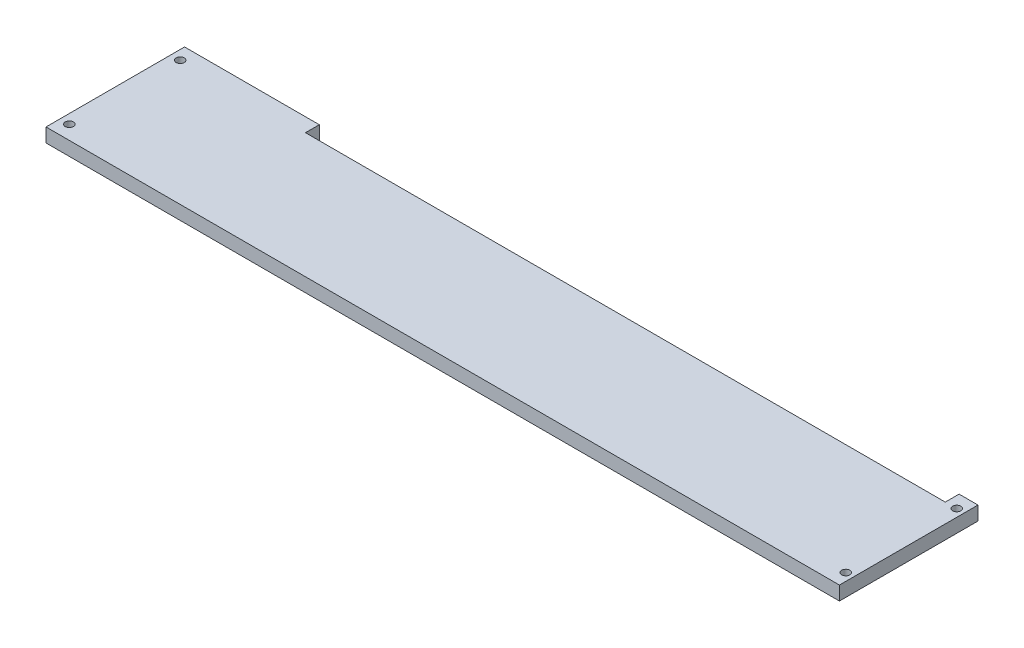
ISO-10303-21;
HEADER;
FILE_DESCRIPTION(('STEP AP214'),'2;1');
FILE_NAME('part.step','',(''),(''),'','','');
FILE_SCHEMA(('AUTOMOTIVE_DESIGN { 1 0 10303 214 1 1 1 1 }'));
ENDSEC;
DATA;
#1=APPLICATION_CONTEXT('core data for automotive mechanical design processes');
#2=APPLICATION_PROTOCOL_DEFINITION('international standard','automotive_design',2000,#1);
#3=PRODUCT_CONTEXT('',#1,'mechanical');
#4=PRODUCT('Part','Part','',(#3));
#5=PRODUCT_RELATED_PRODUCT_CATEGORY('part','',(#4));
#6=PRODUCT_DEFINITION_FORMATION('','',#4);
#7=PRODUCT_DEFINITION_CONTEXT('part definition',#1,'design');
#8=PRODUCT_DEFINITION('design','',#6,#7);
#9=PRODUCT_DEFINITION_SHAPE('','',#8);
#10=(LENGTH_UNIT() NAMED_UNIT(*) SI_UNIT(.MILLI.,.METRE.));
#11=(NAMED_UNIT(*) PLANE_ANGLE_UNIT() SI_UNIT($,.RADIAN.));
#12=(NAMED_UNIT(*) SI_UNIT($,.STERADIAN.) SOLID_ANGLE_UNIT());
#13=UNCERTAINTY_MEASURE_WITH_UNIT(LENGTH_MEASURE(1.E-05),#10,'distance_accuracy_value','');
#14=(GEOMETRIC_REPRESENTATION_CONTEXT(3) GLOBAL_UNCERTAINTY_ASSIGNED_CONTEXT((#13)) GLOBAL_UNIT_ASSIGNED_CONTEXT((#10,
#11,#12)) REPRESENTATION_CONTEXT('',''));
#15=CARTESIAN_POINT('',(0.,0.,0.));
#16=DIRECTION('',(0.,0.,1.));
#17=DIRECTION('',(1.,0.,0.));
#18=AXIS2_PLACEMENT_3D('',#15,#16,#17);
#19=CARTESIAN_POINT('',(540.4,-0.000999999999999265,85.68));
#20=DIRECTION('',(0.,1.,0.));
#21=DIRECTION('',(0.,0.,1.));
#22=AXIS2_PLACEMENT_3D('',#19,#20,#21);
#23=CYLINDRICAL_SURFACE('',#22,2.79499999999996);
#24=CARTESIAN_POINT('',(540.4,9.55,85.68));
#25=DIRECTION('',(0.,1.,0.));
#26=DIRECTION('',(0.,0.,1.));
#27=AXIS2_PLACEMENT_3D('',#24,#25,#26);
#28=CIRCLE('',#27,2.79499999999996);
#29=CARTESIAN_POINT('',(540.4,9.55,88.475));
#30=VERTEX_POINT('',#29);
#31=EDGE_CURVE('E195',#30,#30,#28,.T.);
#32=ORIENTED_EDGE('',*,*,#31,.T.);
#33=EDGE_LOOP('',(#32));
#34=FACE_BOUND('',#33,.T.);
#35=CARTESIAN_POINT('',(540.4,5.2,85.68));
#36=DIRECTION('',(0.,-1.,0.));
#37=DIRECTION('',(0.,0.,-1.));
#38=AXIS2_PLACEMENT_3D('',#35,#36,#37);
#39=CIRCLE('',#38,2.79499999999996);
#40=CARTESIAN_POINT('',(540.4,5.2,82.885));
#41=VERTEX_POINT('',#40);
#42=EDGE_CURVE('E37',#41,#41,#39,.F.);
#43=ORIENTED_EDGE('',*,*,#42,.F.);
#44=EDGE_LOOP('',(#43));
#45=FACE_BOUND('',#44,.T.);
#46=ADVANCED_FACE('F33',(#34,#45),#23,.F.);
#47=CARTESIAN_POINT('',(540.4,-0.000999999999999265,9.38));
#48=DIRECTION('',(0.,1.,0.));
#49=DIRECTION('',(0.,0.,1.));
#50=AXIS2_PLACEMENT_3D('',#47,#48,#49);
#51=CYLINDRICAL_SURFACE('',#50,2.79499999999996);
#52=CARTESIAN_POINT('',(540.4,9.55,9.38));
#53=DIRECTION('',(0.,1.,0.));
#54=DIRECTION('',(0.,0.,1.));
#55=AXIS2_PLACEMENT_3D('',#52,#53,#54);
#56=CIRCLE('',#55,2.79499999999996);
#57=CARTESIAN_POINT('',(540.4,9.55,12.175));
#58=VERTEX_POINT('',#57);
#59=EDGE_CURVE('E162',#58,#58,#56,.T.);
#60=ORIENTED_EDGE('',*,*,#59,.T.);
#61=EDGE_LOOP('',(#60));
#62=FACE_BOUND('',#61,.T.);
#63=CARTESIAN_POINT('',(540.4,5.2,9.38));
#64=DIRECTION('',(0.,-1.,0.));
#65=DIRECTION('',(0.,0.,-1.));
#66=AXIS2_PLACEMENT_3D('',#63,#64,#65);
#67=CIRCLE('',#66,2.79499999999996);
#68=CARTESIAN_POINT('',(540.4,5.2,6.58500000000004));
#69=VERTEX_POINT('',#68);
#70=EDGE_CURVE('E168',#69,#69,#67,.F.);
#71=ORIENTED_EDGE('',*,*,#70,.F.);
#72=EDGE_LOOP('',(#71));
#73=FACE_BOUND('',#72,.T.);
#74=ADVANCED_FACE('F237',(#62,#73),#51,.F.);
#75=CARTESIAN_POINT('',(6.40000000000001,-0.000999999999999265,9.38));
#76=DIRECTION('',(0.,1.,0.));
#77=DIRECTION('',(0.,0.,1.));
#78=AXIS2_PLACEMENT_3D('',#75,#76,#77);
#79=CYLINDRICAL_SURFACE('',#78,2.795);
#80=CARTESIAN_POINT('',(6.40000000000001,9.55,9.38));
#81=DIRECTION('',(0.,1.,0.));
#82=DIRECTION('',(0.,0.,1.));
#83=AXIS2_PLACEMENT_3D('',#80,#81,#82);
#84=CIRCLE('',#83,2.795);
#85=CARTESIAN_POINT('',(6.40000000000001,9.55,12.175));
#86=VERTEX_POINT('',#85);
#87=EDGE_CURVE('E136',#86,#86,#84,.T.);
#88=ORIENTED_EDGE('',*,*,#87,.T.);
#89=EDGE_LOOP('',(#88));
#90=FACE_BOUND('',#89,.T.);
#91=CARTESIAN_POINT('',(6.40000000000001,5.2,9.38));
#92=DIRECTION('',(0.,-1.,0.));
#93=DIRECTION('',(0.,0.,-1.));
#94=AXIS2_PLACEMENT_3D('',#91,#92,#93);
#95=CIRCLE('',#94,2.795);
#96=CARTESIAN_POINT('',(6.40000000000001,5.2,6.585));
#97=VERTEX_POINT('',#96);
#98=EDGE_CURVE('E164',#97,#97,#95,.F.);
#99=ORIENTED_EDGE('',*,*,#98,.F.);
#100=EDGE_LOOP('',(#99));
#101=FACE_BOUND('',#100,.T.);
#102=ADVANCED_FACE('F243',(#90,#101),#79,.F.);
#103=CARTESIAN_POINT('',(6.40000000000001,-0.000999999999999265,85.68));
#104=DIRECTION('',(0.,1.,0.));
#105=DIRECTION('',(0.,0.,1.));
#106=AXIS2_PLACEMENT_3D('',#103,#104,#105);
#107=CYLINDRICAL_SURFACE('',#106,2.795);
#108=CARTESIAN_POINT('',(6.40000000000001,9.55,85.68));
#109=DIRECTION('',(0.,1.,0.));
#110=DIRECTION('',(0.,0.,1.));
#111=AXIS2_PLACEMENT_3D('',#108,#109,#110);
#112=CIRCLE('',#111,2.795);
#113=CARTESIAN_POINT('',(6.40000000000001,9.55,88.475));
#114=VERTEX_POINT('',#113);
#115=EDGE_CURVE('E198',#114,#114,#112,.T.);
#116=ORIENTED_EDGE('',*,*,#115,.T.);
#117=EDGE_LOOP('',(#116));
#118=FACE_BOUND('',#117,.T.);
#119=CARTESIAN_POINT('',(6.40000000000001,5.2,85.68));
#120=DIRECTION('',(0.,-1.,0.));
#121=DIRECTION('',(0.,0.,-1.));
#122=AXIS2_PLACEMENT_3D('',#119,#120,#121);
#123=CIRCLE('',#122,2.795);
#124=CARTESIAN_POINT('',(6.40000000000001,5.2,82.885));
#125=VERTEX_POINT('',#124);
#126=EDGE_CURVE('E159',#125,#125,#123,.F.);
#127=ORIENTED_EDGE('',*,*,#126,.F.);
#128=EDGE_LOOP('',(#127));
#129=FACE_BOUND('',#128,.T.);
#130=ADVANCED_FACE('F249',(#118,#129),#107,.F.);
#131=CARTESIAN_POINT('',(0.,9.55,0.));
#132=DIRECTION('',(1.,0.,0.));
#133=DIRECTION('',(0.,0.,-1.));
#134=AXIS2_PLACEMENT_3D('',#131,#132,#133);
#135=PLANE('',#134);
#136=DIRECTION('',(0.,0.,1.));
#137=VECTOR('',#136,1.);
#138=CARTESIAN_POINT('',(0.,0.,0.));
#139=LINE('',#138,#137);
#140=CARTESIAN_POINT('',(0.,0.,0.));
#141=VERTEX_POINT('',#140);
#142=CARTESIAN_POINT('',(0.,0.,95.3));
#143=VERTEX_POINT('',#142);
#144=EDGE_CURVE('E132',#141,#143,#139,.T.);
#145=ORIENTED_EDGE('',*,*,#144,.T.);
#146=DIRECTION('',(0.,-1.,0.));
#147=VECTOR('',#146,1.);
#148=CARTESIAN_POINT('',(0.,9.55,95.3));
#149=LINE('',#148,#147);
#150=CARTESIAN_POINT('',(0.,9.55,95.3));
#151=VERTEX_POINT('',#150);
#152=EDGE_CURVE('E11',#151,#143,#149,.T.);
#153=ORIENTED_EDGE('',*,*,#152,.F.);
#154=DIRECTION('',(0.,0.,1.));
#155=VECTOR('',#154,1.);
#156=CARTESIAN_POINT('',(0.,9.55,0.));
#157=LINE('',#156,#155);
#158=CARTESIAN_POINT('',(0.,9.55,0.));
#159=VERTEX_POINT('',#158);
#160=EDGE_CURVE('E147',#159,#151,#157,.T.);
#161=ORIENTED_EDGE('',*,*,#160,.F.);
#162=DIRECTION('',(0.,-1.,0.));
#163=VECTOR('',#162,1.);
#164=CARTESIAN_POINT('',(0.,9.55,0.));
#165=LINE('',#164,#163);
#166=EDGE_CURVE('E128',#159,#141,#165,.T.);
#167=ORIENTED_EDGE('',*,*,#166,.T.);
#168=EDGE_LOOP('',(#145,#153,#161,#167));
#169=FACE_BOUND('',#168,.T.);
#170=ADVANCED_FACE('F35',(#169),#135,.F.);
#171=CARTESIAN_POINT('',(0.,9.55,95.3));
#172=DIRECTION('',(0.,0.,-1.));
#173=DIRECTION('',(-1.,0.,0.));
#174=AXIS2_PLACEMENT_3D('',#171,#172,#173);
#175=PLANE('',#174);
#176=DIRECTION('',(1.,0.,0.));
#177=VECTOR('',#176,1.);
#178=CARTESIAN_POINT('',(0.,0.,95.3));
#179=LINE('',#178,#177);
#180=CARTESIAN_POINT('',(545.64,0.,95.3));
#181=VERTEX_POINT('',#180);
#182=EDGE_CURVE('E135',#143,#181,#179,.T.);
#183=ORIENTED_EDGE('',*,*,#182,.T.);
#184=DIRECTION('',(0.,-1.,0.));
#185=VECTOR('',#184,1.);
#186=CARTESIAN_POINT('',(545.64,9.55,95.3));
#187=LINE('',#186,#185);
#188=CARTESIAN_POINT('',(545.64,9.55,95.3));
#189=VERTEX_POINT('',#188);
#190=EDGE_CURVE('E43',#189,#181,#187,.T.);
#191=ORIENTED_EDGE('',*,*,#190,.F.);
#192=DIRECTION('',(1.,0.,0.));
#193=VECTOR('',#192,1.);
#194=CARTESIAN_POINT('',(0.,9.55,95.3));
#195=LINE('',#194,#193);
#196=EDGE_CURVE('E95',#151,#189,#195,.T.);
#197=ORIENTED_EDGE('',*,*,#196,.F.);
#198=ORIENTED_EDGE('',*,*,#152,.T.);
#199=EDGE_LOOP('',(#183,#191,#197,#198));
#200=FACE_BOUND('',#199,.T.);
#201=ADVANCED_FACE('F415',(#200),#175,.F.);
#202=CARTESIAN_POINT('',(545.64,9.55,0.));
#203=DIRECTION('',(-1.,0.,0.));
#204=DIRECTION('',(0.,0.,1.));
#205=AXIS2_PLACEMENT_3D('',#202,#203,#204);
#206=PLANE('',#205);
#207=DIRECTION('',(0.,0.,-1.));
#208=VECTOR('',#207,1.);
#209=CARTESIAN_POINT('',(545.64,0.,0.));
#210=LINE('',#209,#208);
#211=CARTESIAN_POINT('',(545.64,0.,0.));
#212=VERTEX_POINT('',#211);
#213=EDGE_CURVE('E138',#181,#212,#210,.T.);
#214=ORIENTED_EDGE('',*,*,#213,.T.);
#215=DIRECTION('',(0.,-1.,0.));
#216=VECTOR('',#215,1.);
#217=CARTESIAN_POINT('',(545.64,9.55,0.));
#218=LINE('',#217,#216);
#219=CARTESIAN_POINT('',(545.64,9.55,0.));
#220=VERTEX_POINT('',#219);
#221=EDGE_CURVE('E154',#220,#212,#218,.T.);
#222=ORIENTED_EDGE('',*,*,#221,.F.);
#223=DIRECTION('',(0.,0.,-1.));
#224=VECTOR('',#223,1.);
#225=CARTESIAN_POINT('',(545.64,9.55,0.));
#226=LINE('',#225,#224);
#227=EDGE_CURVE('E205',#189,#220,#226,.T.);
#228=ORIENTED_EDGE('',*,*,#227,.F.);
#229=ORIENTED_EDGE('',*,*,#190,.T.);
#230=EDGE_LOOP('',(#214,#222,#228,#229));
#231=FACE_BOUND('',#230,.T.);
#232=ADVANCED_FACE('F407',(#231),#206,.F.);
#233=CARTESIAN_POINT('',(532.64,9.55,0.));
#234=DIRECTION('',(0.,0.,1.));
#235=DIRECTION('',(1.,0.,0.));
#236=AXIS2_PLACEMENT_3D('',#233,#234,#235);
#237=PLANE('',#236);
#238=DIRECTION('',(-1.,0.,0.));
#239=VECTOR('',#238,1.);
#240=CARTESIAN_POINT('',(532.64,0.,0.));
#241=LINE('',#240,#239);
#242=CARTESIAN_POINT('',(532.64,0.,0.));
#243=VERTEX_POINT('',#242);
#244=EDGE_CURVE('E140',#212,#243,#241,.T.);
#245=ORIENTED_EDGE('',*,*,#244,.T.);
#246=DIRECTION('',(0.,-1.,0.));
#247=VECTOR('',#246,1.);
#248=CARTESIAN_POINT('',(532.64,9.55,0.));
#249=LINE('',#248,#247);
#250=CARTESIAN_POINT('',(532.64,9.55,0.));
#251=VERTEX_POINT('',#250);
#252=EDGE_CURVE('E151',#251,#243,#249,.T.);
#253=ORIENTED_EDGE('',*,*,#252,.F.);
#254=DIRECTION('',(-1.,0.,0.));
#255=VECTOR('',#254,1.);
#256=CARTESIAN_POINT('',(532.64,9.55,0.));
#257=LINE('',#256,#255);
#258=EDGE_CURVE('E207',#220,#251,#257,.T.);
#259=ORIENTED_EDGE('',*,*,#258,.F.);
#260=ORIENTED_EDGE('',*,*,#221,.T.);
#261=EDGE_LOOP('',(#245,#253,#259,#260));
#262=FACE_BOUND('',#261,.T.);
#263=ADVANCED_FACE('F213',(#262),#237,.F.);
#264=CARTESIAN_POINT('',(532.64,9.55,0.));
#265=DIRECTION('',(1.,0.,0.));
#266=DIRECTION('',(0.,0.,-1.));
#267=AXIS2_PLACEMENT_3D('',#264,#265,#266);
#268=PLANE('',#267);
#269=DIRECTION('',(0.,0.,1.));
#270=VECTOR('',#269,1.);
#271=CARTESIAN_POINT('',(532.64,0.,0.));
#272=LINE('',#271,#270);
#273=CARTESIAN_POINT('',(532.64,0.,9.5));
#274=VERTEX_POINT('',#273);
#275=EDGE_CURVE('E142',#243,#274,#272,.T.);
#276=ORIENTED_EDGE('',*,*,#275,.T.);
#277=DIRECTION('',(0.,-1.,0.));
#278=VECTOR('',#277,1.);
#279=CARTESIAN_POINT('',(532.64,9.55,9.5));
#280=LINE('',#279,#278);
#281=CARTESIAN_POINT('',(532.64,9.55,9.5));
#282=VERTEX_POINT('',#281);
#283=EDGE_CURVE('E123',#282,#274,#280,.T.);
#284=ORIENTED_EDGE('',*,*,#283,.F.);
#285=DIRECTION('',(0.,0.,1.));
#286=VECTOR('',#285,1.);
#287=CARTESIAN_POINT('',(532.64,9.55,0.));
#288=LINE('',#287,#286);
#289=EDGE_CURVE('E114',#251,#282,#288,.T.);
#290=ORIENTED_EDGE('',*,*,#289,.F.);
#291=ORIENTED_EDGE('',*,*,#252,.T.);
#292=EDGE_LOOP('',(#276,#284,#290,#291));
#293=FACE_BOUND('',#292,.T.);
#294=ADVANCED_FACE('F217',(#293),#268,.F.);
#295=CARTESIAN_POINT('',(92.64,9.55,9.5));
#296=DIRECTION('',(0.,0.,1.));
#297=DIRECTION('',(1.,0.,0.));
#298=AXIS2_PLACEMENT_3D('',#295,#296,#297);
#299=PLANE('',#298);
#300=DIRECTION('',(-1.,0.,0.));
#301=VECTOR('',#300,1.);
#302=CARTESIAN_POINT('',(92.64,0.,9.5));
#303=LINE('',#302,#301);
#304=CARTESIAN_POINT('',(92.64,0.,9.5));
#305=VERTEX_POINT('',#304);
#306=EDGE_CURVE('E122',#274,#305,#303,.T.);
#307=ORIENTED_EDGE('',*,*,#306,.T.);
#308=DIRECTION('',(0.,-1.,0.));
#309=VECTOR('',#308,1.);
#310=CARTESIAN_POINT('',(92.64,9.55,9.5));
#311=LINE('',#310,#309);
#312=CARTESIAN_POINT('',(92.64,9.55,9.5));
#313=VERTEX_POINT('',#312);
#314=EDGE_CURVE('E119',#313,#305,#311,.T.);
#315=ORIENTED_EDGE('',*,*,#314,.F.);
#316=DIRECTION('',(-1.,0.,0.));
#317=VECTOR('',#316,1.);
#318=CARTESIAN_POINT('',(92.64,9.55,9.5));
#319=LINE('',#318,#317);
#320=EDGE_CURVE('E108',#282,#313,#319,.T.);
#321=ORIENTED_EDGE('',*,*,#320,.F.);
#322=ORIENTED_EDGE('',*,*,#283,.T.);
#323=EDGE_LOOP('',(#307,#315,#321,#322));
#324=FACE_BOUND('',#323,.T.);
#325=ADVANCED_FACE('F120',(#324),#299,.F.);
#326=CARTESIAN_POINT('',(92.64,9.55,0.));
#327=DIRECTION('',(-1.,0.,0.));
#328=DIRECTION('',(0.,0.,1.));
#329=AXIS2_PLACEMENT_3D('',#326,#327,#328);
#330=PLANE('',#329);
#331=DIRECTION('',(0.,0.,-1.));
#332=VECTOR('',#331,1.);
#333=CARTESIAN_POINT('',(92.64,0.,0.));
#334=LINE('',#333,#332);
#335=CARTESIAN_POINT('',(92.64,0.,0.));
#336=VERTEX_POINT('',#335);
#337=EDGE_CURVE('E81',#305,#336,#334,.T.);
#338=ORIENTED_EDGE('',*,*,#337,.T.);
#339=DIRECTION('',(0.,-1.,0.));
#340=VECTOR('',#339,1.);
#341=CARTESIAN_POINT('',(92.64,9.55,0.));
#342=LINE('',#341,#340);
#343=CARTESIAN_POINT('',(92.64,9.55,0.));
#344=VERTEX_POINT('',#343);
#345=EDGE_CURVE('E124',#344,#336,#342,.T.);
#346=ORIENTED_EDGE('',*,*,#345,.F.);
#347=DIRECTION('',(0.,0.,-1.));
#348=VECTOR('',#347,1.);
#349=CARTESIAN_POINT('',(92.64,9.55,0.));
#350=LINE('',#349,#348);
#351=EDGE_CURVE('E112',#313,#344,#350,.T.);
#352=ORIENTED_EDGE('',*,*,#351,.F.);
#353=ORIENTED_EDGE('',*,*,#314,.T.);
#354=EDGE_LOOP('',(#338,#346,#352,#353));
#355=FACE_BOUND('',#354,.T.);
#356=ADVANCED_FACE('F126',(#355),#330,.F.);
#357=CARTESIAN_POINT('',(0.,9.55,0.));
#358=DIRECTION('',(0.,0.,1.));
#359=DIRECTION('',(1.,0.,0.));
#360=AXIS2_PLACEMENT_3D('',#357,#358,#359);
#361=PLANE('',#360);
#362=DIRECTION('',(-1.,0.,0.));
#363=VECTOR('',#362,1.);
#364=CARTESIAN_POINT('',(0.,0.,0.));
#365=LINE('',#364,#363);
#366=EDGE_CURVE('E87',#336,#141,#365,.T.);
#367=ORIENTED_EDGE('',*,*,#366,.T.);
#368=ORIENTED_EDGE('',*,*,#166,.F.);
#369=DIRECTION('',(-1.,0.,0.));
#370=VECTOR('',#369,1.);
#371=CARTESIAN_POINT('',(0.,9.55,0.));
#372=LINE('',#371,#370);
#373=EDGE_CURVE('E52',#344,#159,#372,.T.);
#374=ORIENTED_EDGE('',*,*,#373,.F.);
#375=ORIENTED_EDGE('',*,*,#345,.T.);
#376=EDGE_LOOP('',(#367,#368,#374,#375));
#377=FACE_BOUND('',#376,.T.);
#378=ADVANCED_FACE('F225',(#377),#361,.F.);
#379=CARTESIAN_POINT('',(0.,9.55,95.3));
#380=DIRECTION('',(0.,1.,0.));
#381=DIRECTION('',(0.,0.,1.));
#382=AXIS2_PLACEMENT_3D('',#379,#380,#381);
#383=PLANE('',#382);
#384=ORIENTED_EDGE('',*,*,#59,.F.);
#385=EDGE_LOOP('',(#384));
#386=FACE_BOUND('',#385,.T.);
#387=ORIENTED_EDGE('',*,*,#31,.F.);
#388=EDGE_LOOP('',(#387));
#389=FACE_BOUND('',#388,.T.);
#390=ORIENTED_EDGE('',*,*,#115,.F.);
#391=EDGE_LOOP('',(#390));
#392=FACE_BOUND('',#391,.T.);
#393=ORIENTED_EDGE('',*,*,#87,.F.);
#394=EDGE_LOOP('',(#393));
#395=FACE_BOUND('',#394,.T.);
#396=ORIENTED_EDGE('',*,*,#160,.T.);
#397=ORIENTED_EDGE('',*,*,#196,.T.);
#398=ORIENTED_EDGE('',*,*,#227,.T.);
#399=ORIENTED_EDGE('',*,*,#258,.T.);
#400=ORIENTED_EDGE('',*,*,#289,.T.);
#401=ORIENTED_EDGE('',*,*,#320,.T.);
#402=ORIENTED_EDGE('',*,*,#351,.T.);
#403=ORIENTED_EDGE('',*,*,#373,.T.);
#404=EDGE_LOOP('',(#396,#397,#398,#399,#400,#401,#402,#403));
#405=FACE_BOUND('',#404,.T.);
#406=ADVANCED_FACE('F110',(#386,#389,#392,#395,#405),#383,.T.);
#407=CARTESIAN_POINT('',(0.,0.,95.3));
#408=DIRECTION('',(0.,1.,0.));
#409=DIRECTION('',(0.,0.,1.));
#410=AXIS2_PLACEMENT_3D('',#407,#408,#409);
#411=PLANE('',#410);
#412=CARTESIAN_POINT('',(540.4,0.,85.68));
#413=DIRECTION('',(0.,-1.,0.));
#414=DIRECTION('',(0.,0.,-1.));
#415=AXIS2_PLACEMENT_3D('',#412,#413,#414);
#416=CIRCLE('',#415,4.61000000000005);
#417=CARTESIAN_POINT('',(540.4,0.,81.07));
#418=VERTEX_POINT('',#417);
#419=EDGE_CURVE('E184',#418,#418,#416,.T.);
#420=ORIENTED_EDGE('',*,*,#419,.F.);
#421=EDGE_LOOP('',(#420));
#422=FACE_BOUND('',#421,.T.);
#423=CARTESIAN_POINT('',(540.4,0.,9.38));
#424=DIRECTION('',(0.,-1.,0.));
#425=DIRECTION('',(0.,0.,-1.));
#426=AXIS2_PLACEMENT_3D('',#423,#424,#425);
#427=CIRCLE('',#426,4.61000000000005);
#428=CARTESIAN_POINT('',(540.4,0.,4.76999999999995));
#429=VERTEX_POINT('',#428);
#430=EDGE_CURVE('E177',#429,#429,#427,.T.);
#431=ORIENTED_EDGE('',*,*,#430,.F.);
#432=EDGE_LOOP('',(#431));
#433=FACE_BOUND('',#432,.T.);
#434=CARTESIAN_POINT('',(6.40000000000001,0.,9.38));
#435=DIRECTION('',(0.,-1.,0.));
#436=DIRECTION('',(0.,0.,-1.));
#437=AXIS2_PLACEMENT_3D('',#434,#435,#436);
#438=CIRCLE('',#437,4.61);
#439=CARTESIAN_POINT('',(6.40000000000001,0.,4.77));
#440=VERTEX_POINT('',#439);
#441=EDGE_CURVE('E170',#440,#440,#438,.T.);
#442=ORIENTED_EDGE('',*,*,#441,.F.);
#443=EDGE_LOOP('',(#442));
#444=FACE_BOUND('',#443,.T.);
#445=CARTESIAN_POINT('',(6.40000000000001,0.,85.68));
#446=DIRECTION('',(0.,-1.,0.));
#447=DIRECTION('',(0.,0.,-1.));
#448=AXIS2_PLACEMENT_3D('',#445,#446,#447);
#449=CIRCLE('',#448,4.61);
#450=CARTESIAN_POINT('',(6.40000000000001,0.,81.07));
#451=VERTEX_POINT('',#450);
#452=EDGE_CURVE('E166',#451,#451,#449,.T.);
#453=ORIENTED_EDGE('',*,*,#452,.F.);
#454=EDGE_LOOP('',(#453));
#455=FACE_BOUND('',#454,.T.);
#456=ORIENTED_EDGE('',*,*,#144,.F.);
#457=ORIENTED_EDGE('',*,*,#366,.F.);
#458=ORIENTED_EDGE('',*,*,#337,.F.);
#459=ORIENTED_EDGE('',*,*,#306,.F.);
#460=ORIENTED_EDGE('',*,*,#275,.F.);
#461=ORIENTED_EDGE('',*,*,#244,.F.);
#462=ORIENTED_EDGE('',*,*,#213,.F.);
#463=ORIENTED_EDGE('',*,*,#182,.F.);
#464=EDGE_LOOP('',(#456,#457,#458,#459,#460,#461,#462,#463));
#465=FACE_BOUND('',#464,.T.);
#466=ADVANCED_FACE('F220',(#422,#433,#444,#455,#465),#411,.F.);
#467=CARTESIAN_POINT('',(6.40000000000001,5.2,85.68));
#468=DIRECTION('',(0.,-1.,0.));
#469=DIRECTION('',(0.,0.,-1.));
#470=AXIS2_PLACEMENT_3D('',#467,#468,#469);
#471=PLANE('',#470);
#472=CARTESIAN_POINT('',(6.40000000000001,5.2,85.68));
#473=DIRECTION('',(0.,-1.,0.));
#474=DIRECTION('',(0.,0.,-1.));
#475=AXIS2_PLACEMENT_3D('',#472,#473,#474);
#476=CIRCLE('',#475,4.61);
#477=CARTESIAN_POINT('',(6.40000000000001,5.2,81.07));
#478=VERTEX_POINT('',#477);
#479=EDGE_CURVE('E163',#478,#478,#476,.T.);
#480=ORIENTED_EDGE('',*,*,#479,.T.);
#481=EDGE_LOOP('',(#480));
#482=FACE_BOUND('',#481,.T.);
#483=ORIENTED_EDGE('',*,*,#126,.T.);
#484=EDGE_LOOP('',(#483));
#485=FACE_BOUND('',#484,.T.);
#486=ADVANCED_FACE('F256',(#482,#485),#471,.T.);
#487=CARTESIAN_POINT('',(6.40000000000001,5.2,85.68));
#488=DIRECTION('',(0.,-1.,0.));
#489=DIRECTION('',(0.,0.,-1.));
#490=AXIS2_PLACEMENT_3D('',#487,#488,#489);
#491=CYLINDRICAL_SURFACE('',#490,4.61);
#492=ORIENTED_EDGE('',*,*,#479,.F.);
#493=EDGE_LOOP('',(#492));
#494=FACE_BOUND('',#493,.T.);
#495=ORIENTED_EDGE('',*,*,#452,.T.);
#496=EDGE_LOOP('',(#495));
#497=FACE_BOUND('',#496,.T.);
#498=ADVANCED_FACE('F261',(#494,#497),#491,.F.);
#499=CARTESIAN_POINT('',(6.40000000000001,5.2,9.38));
#500=DIRECTION('',(0.,-1.,0.));
#501=DIRECTION('',(0.,0.,-1.));
#502=AXIS2_PLACEMENT_3D('',#499,#500,#501);
#503=PLANE('',#502);
#504=CARTESIAN_POINT('',(6.40000000000001,5.2,9.38));
#505=DIRECTION('',(0.,-1.,0.));
#506=DIRECTION('',(0.,0.,-1.));
#507=AXIS2_PLACEMENT_3D('',#504,#505,#506);
#508=CIRCLE('',#507,4.61);
#509=CARTESIAN_POINT('',(6.40000000000001,5.2,4.77));
#510=VERTEX_POINT('',#509);
#511=EDGE_CURVE('E167',#510,#510,#508,.T.);
#512=ORIENTED_EDGE('',*,*,#511,.T.);
#513=EDGE_LOOP('',(#512));
#514=FACE_BOUND('',#513,.T.);
#515=ORIENTED_EDGE('',*,*,#98,.T.);
#516=EDGE_LOOP('',(#515));
#517=FACE_BOUND('',#516,.T.);
#518=ADVANCED_FACE('F274',(#514,#517),#503,.T.);
#519=CARTESIAN_POINT('',(6.40000000000001,5.2,9.38));
#520=DIRECTION('',(0.,-1.,0.));
#521=DIRECTION('',(0.,0.,-1.));
#522=AXIS2_PLACEMENT_3D('',#519,#520,#521);
#523=CYLINDRICAL_SURFACE('',#522,4.61);
#524=ORIENTED_EDGE('',*,*,#511,.F.);
#525=EDGE_LOOP('',(#524));
#526=FACE_BOUND('',#525,.T.);
#527=ORIENTED_EDGE('',*,*,#441,.T.);
#528=EDGE_LOOP('',(#527));
#529=FACE_BOUND('',#528,.T.);
#530=ADVANCED_FACE('F279',(#526,#529),#523,.F.);
#531=CARTESIAN_POINT('',(540.4,5.2,9.38));
#532=DIRECTION('',(0.,-1.,0.));
#533=DIRECTION('',(0.,0.,-1.));
#534=AXIS2_PLACEMENT_3D('',#531,#532,#533);
#535=PLANE('',#534);
#536=CARTESIAN_POINT('',(540.4,5.2,9.38));
#537=DIRECTION('',(0.,-1.,0.));
#538=DIRECTION('',(0.,0.,-1.));
#539=AXIS2_PLACEMENT_3D('',#536,#537,#538);
#540=CIRCLE('',#539,4.61000000000005);
#541=CARTESIAN_POINT('',(540.4,5.2,4.76999999999995));
#542=VERTEX_POINT('',#541);
#543=EDGE_CURVE('E171',#542,#542,#540,.T.);
#544=ORIENTED_EDGE('',*,*,#543,.T.);
#545=EDGE_LOOP('',(#544));
#546=FACE_BOUND('',#545,.T.);
#547=ORIENTED_EDGE('',*,*,#70,.T.);
#548=EDGE_LOOP('',(#547));
#549=FACE_BOUND('',#548,.T.);
#550=ADVANCED_FACE('F285',(#546,#549),#535,.T.);
#551=CARTESIAN_POINT('',(540.4,5.2,9.38));
#552=DIRECTION('',(0.,-1.,0.));
#553=DIRECTION('',(0.,0.,-1.));
#554=AXIS2_PLACEMENT_3D('',#551,#552,#553);
#555=CYLINDRICAL_SURFACE('',#554,4.61000000000005);
#556=ORIENTED_EDGE('',*,*,#543,.F.);
#557=EDGE_LOOP('',(#556));
#558=FACE_BOUND('',#557,.T.);
#559=ORIENTED_EDGE('',*,*,#430,.T.);
#560=EDGE_LOOP('',(#559));
#561=FACE_BOUND('',#560,.T.);
#562=ADVANCED_FACE('F288',(#558,#561),#555,.F.);
#563=CARTESIAN_POINT('',(540.4,5.2,85.68));
#564=DIRECTION('',(0.,-1.,0.));
#565=DIRECTION('',(0.,0.,-1.));
#566=AXIS2_PLACEMENT_3D('',#563,#564,#565);
#567=PLANE('',#566);
#568=CARTESIAN_POINT('',(540.4,5.2,85.68));
#569=DIRECTION('',(0.,-1.,0.));
#570=DIRECTION('',(0.,0.,-1.));
#571=AXIS2_PLACEMENT_3D('',#568,#569,#570);
#572=CIRCLE('',#571,4.61000000000005);
#573=CARTESIAN_POINT('',(540.4,5.2,81.07));
#574=VERTEX_POINT('',#573);
#575=EDGE_CURVE('E306',#574,#574,#572,.T.);
#576=ORIENTED_EDGE('',*,*,#575,.T.);
#577=EDGE_LOOP('',(#576));
#578=FACE_BOUND('',#577,.T.);
#579=ORIENTED_EDGE('',*,*,#42,.T.);
#580=EDGE_LOOP('',(#579));
#581=FACE_BOUND('',#580,.T.);
#582=ADVANCED_FACE('F291',(#578,#581),#567,.T.);
#583=CARTESIAN_POINT('',(540.4,5.2,85.68));
#584=DIRECTION('',(0.,-1.,0.));
#585=DIRECTION('',(0.,0.,-1.));
#586=AXIS2_PLACEMENT_3D('',#583,#584,#585);
#587=CYLINDRICAL_SURFACE('',#586,4.61000000000005);
#588=ORIENTED_EDGE('',*,*,#575,.F.);
#589=EDGE_LOOP('',(#588));
#590=FACE_BOUND('',#589,.T.);
#591=ORIENTED_EDGE('',*,*,#419,.T.);
#592=EDGE_LOOP('',(#591));
#593=FACE_BOUND('',#592,.T.);
#594=ADVANCED_FACE('F295',(#590,#593),#587,.F.);
#595=CLOSED_SHELL('',(#46,#74,#102,#130,#170,#201,#232,#263,#294,#325,#356,#378,#406,#466,#486,
#498,#518,#530,#550,#562,#582,#594));
#596=MANIFOLD_SOLID_BREP('B2',#595);
#597=ADVANCED_BREP_SHAPE_REPRESENTATION('',(#18,#596),#14);
#598=SHAPE_DEFINITION_REPRESENTATION(#9,#597);
ENDSEC;
END-ISO-10303-21;
